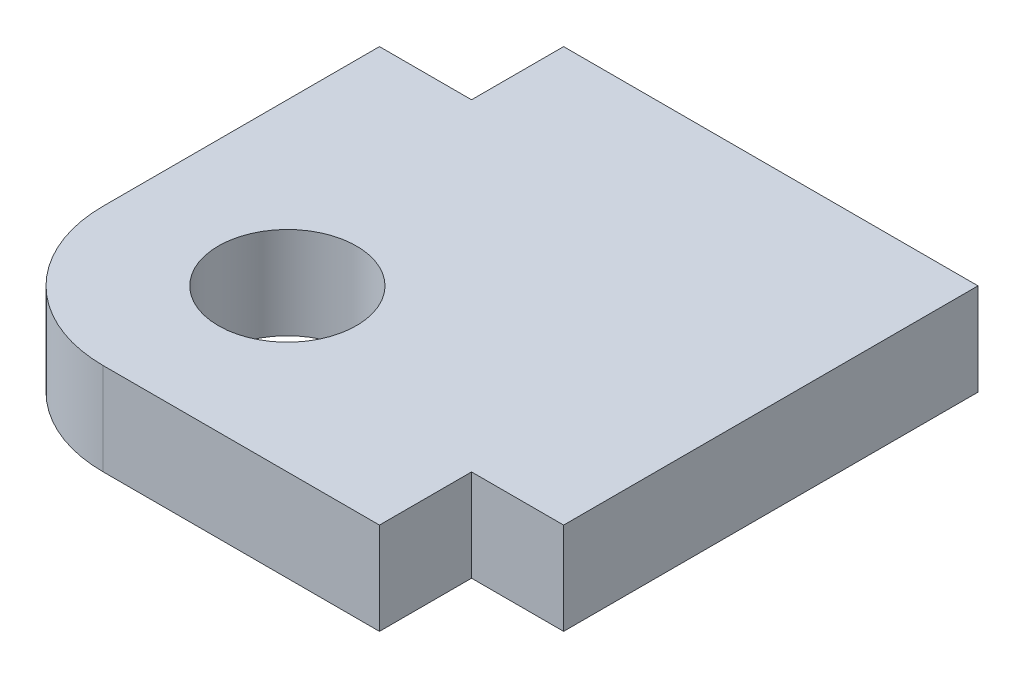
ISO-10303-21;
HEADER;
FILE_DESCRIPTION(('STEP AP214'),'2;1');
FILE_NAME('part.step','',(''),(''),'','','');
FILE_SCHEMA(('AUTOMOTIVE_DESIGN { 1 0 10303 214 1 1 1 1 }'));
ENDSEC;
DATA;
#1=APPLICATION_CONTEXT('core data for automotive mechanical design processes');
#2=APPLICATION_PROTOCOL_DEFINITION('international standard','automotive_design',2000,#1);
#3=PRODUCT_CONTEXT('',#1,'mechanical');
#4=PRODUCT('Part','Part','',(#3));
#5=PRODUCT_RELATED_PRODUCT_CATEGORY('part','',(#4));
#6=PRODUCT_DEFINITION_FORMATION('','',#4);
#7=PRODUCT_DEFINITION_CONTEXT('part definition',#1,'design');
#8=PRODUCT_DEFINITION('design','',#6,#7);
#9=PRODUCT_DEFINITION_SHAPE('','',#8);
#10=(LENGTH_UNIT() NAMED_UNIT(*) SI_UNIT(.MILLI.,.METRE.));
#11=(NAMED_UNIT(*) PLANE_ANGLE_UNIT() SI_UNIT($,.RADIAN.));
#12=(NAMED_UNIT(*) SI_UNIT($,.STERADIAN.) SOLID_ANGLE_UNIT());
#13=UNCERTAINTY_MEASURE_WITH_UNIT(LENGTH_MEASURE(1.E-05),#10,'distance_accuracy_value','');
#14=(GEOMETRIC_REPRESENTATION_CONTEXT(3) GLOBAL_UNCERTAINTY_ASSIGNED_CONTEXT((#13)) GLOBAL_UNIT_ASSIGNED_CONTEXT((#10,
#11,#12)) REPRESENTATION_CONTEXT('',''));
#15=CARTESIAN_POINT('',(0.,0.,0.));
#16=DIRECTION('',(0.,0.,1.));
#17=DIRECTION('',(1.,0.,0.));
#18=AXIS2_PLACEMENT_3D('',#15,#16,#17);
#19=CARTESIAN_POINT('',(-1.62227474992359,2.,2.06113737496184));
#20=DIRECTION('',(0.,1.,0.));
#21=DIRECTION('',(0.,0.,1.));
#22=AXIS2_PLACEMENT_3D('',#19,#20,#21);
#23=PLANE('',#22);
#24=DIRECTION('',(0.,0.,-1.));
#25=VECTOR('',#24,1.);
#26=CARTESIAN_POINT('',(6.37772525007636,2.,3.06113737496179));
#27=LINE('',#26,#25);
#28=CARTESIAN_POINT('',(6.37772525007636,2.,3.06113737496179));
#29=VERTEX_POINT('',#28);
#30=CARTESIAN_POINT('',(6.37772525007639,2.,-5.93886262503823));
#31=VERTEX_POINT('',#30);
#32=EDGE_CURVE('E156',#29,#31,#27,.T.);
#33=ORIENTED_EDGE('',*,*,#32,.T.);
#34=DIRECTION('',(-1.,0.,0.));
#35=VECTOR('',#34,1.);
#36=CARTESIAN_POINT('',(6.37772525007639,2.,-5.93886262503823));
#37=LINE('',#36,#35);
#38=CARTESIAN_POINT('',(-2.62227474992364,2.,-5.93886262503827));
#39=VERTEX_POINT('',#38);
#40=EDGE_CURVE('E99',#31,#39,#37,.T.);
#41=ORIENTED_EDGE('',*,*,#40,.T.);
#42=DIRECTION('',(0.,0.,1.));
#43=VECTOR('',#42,1.);
#44=CARTESIAN_POINT('',(-2.62227474992364,2.,-5.93886262503827));
#45=LINE('',#44,#43);
#46=CARTESIAN_POINT('',(-2.62227474992363,2.,-3.93886262503818));
#47=VERTEX_POINT('',#46);
#48=EDGE_CURVE('E174',#39,#47,#45,.T.);
#49=ORIENTED_EDGE('',*,*,#48,.T.);
#50=DIRECTION('',(-1.,0.,0.));
#51=VECTOR('',#50,1.);
#52=CARTESIAN_POINT('',(-2.62227474992363,2.,-3.93886262503818));
#53=LINE('',#52,#51);
#54=CARTESIAN_POINT('',(-4.6222747499236,2.,-3.93886262503816));
#55=VERTEX_POINT('',#54);
#56=EDGE_CURVE('E191',#47,#55,#53,.T.);
#57=ORIENTED_EDGE('',*,*,#56,.T.);
#58=DIRECTION('',(0.,0.,1.));
#59=VECTOR('',#58,1.);
#60=CARTESIAN_POINT('',(-4.6222747499236,2.,-3.93886262503816));
#61=LINE('',#60,#59);
#62=CARTESIAN_POINT('',(-4.6222747499236,2.,2.06113737496185));
#63=VERTEX_POINT('',#62);
#64=EDGE_CURVE('E190',#55,#63,#61,.T.);
#65=ORIENTED_EDGE('',*,*,#64,.T.);
#66=CARTESIAN_POINT('',(-1.62227474992359,2.,2.06113737496184));
#67=DIRECTION('',(0.,1.,0.));
#68=DIRECTION('',(0.,0.,1.));
#69=AXIS2_PLACEMENT_3D('',#66,#67,#68);
#70=CIRCLE('',#69,3.00000000000001);
#71=CARTESIAN_POINT('',(-1.62227474992359,2.,5.06113737496184));
#72=VERTEX_POINT('',#71);
#73=EDGE_CURVE('E121',#63,#72,#70,.T.);
#74=ORIENTED_EDGE('',*,*,#73,.T.);
#75=DIRECTION('',(1.,0.,0.));
#76=VECTOR('',#75,1.);
#77=CARTESIAN_POINT('',(-1.62227474992359,2.,5.06113737496184));
#78=LINE('',#77,#76);
#79=CARTESIAN_POINT('',(4.3777252500764,2.,5.06113737496183));
#80=VERTEX_POINT('',#79);
#81=EDGE_CURVE('E115',#72,#80,#78,.T.);
#82=ORIENTED_EDGE('',*,*,#81,.T.);
#83=DIRECTION('',(0.,0.,-1.));
#84=VECTOR('',#83,1.);
#85=CARTESIAN_POINT('',(4.3777252500764,2.,5.06113737496183));
#86=LINE('',#85,#84);
#87=CARTESIAN_POINT('',(4.37772525007637,2.,3.06113737496179));
#88=VERTEX_POINT('',#87);
#89=EDGE_CURVE('E119',#80,#88,#86,.T.);
#90=ORIENTED_EDGE('',*,*,#89,.T.);
#91=DIRECTION('',(1.,0.,0.));
#92=VECTOR('',#91,1.);
#93=CARTESIAN_POINT('',(4.37772525007637,2.,3.06113737496179));
#94=LINE('',#93,#92);
#95=EDGE_CURVE('E53',#88,#29,#94,.T.);
#96=ORIENTED_EDGE('',*,*,#95,.T.);
#97=EDGE_LOOP('',(#33,#41,#49,#57,#65,#74,#82,#90,#96));
#98=FACE_BOUND('',#97,.T.);
#99=CARTESIAN_POINT('',(-1.12227474992366,2.,1.56113737496182));
#100=DIRECTION('',(0.,1.,0.));
#101=DIRECTION('',(0.,0.,1.));
#102=AXIS2_PLACEMENT_3D('',#99,#100,#101);
#103=CIRCLE('',#102,1.5);
#104=CARTESIAN_POINT('',(-1.12227474992366,2.,3.06113737496182));
#105=VERTEX_POINT('',#104);
#106=EDGE_CURVE('E143',#105,#105,#103,.T.);
#107=ORIENTED_EDGE('',*,*,#106,.F.);
#108=EDGE_LOOP('',(#107));
#109=FACE_BOUND('',#108,.T.);
#110=ADVANCED_FACE('F36',(#98,#109),#23,.T.);
#111=CARTESIAN_POINT('',(-1.62227474992359,0.,2.06113737496184));
#112=DIRECTION('',(0.,1.,0.));
#113=DIRECTION('',(0.,0.,1.));
#114=AXIS2_PLACEMENT_3D('',#111,#112,#113);
#115=PLANE('',#114);
#116=DIRECTION('',(0.,0.,-1.));
#117=VECTOR('',#116,1.);
#118=CARTESIAN_POINT('',(6.37772525007636,0.,3.06113737496179));
#119=LINE('',#118,#117);
#120=CARTESIAN_POINT('',(6.37772525007636,0.,3.06113737496179));
#121=VERTEX_POINT('',#120);
#122=CARTESIAN_POINT('',(6.37772525007639,0.,-5.93886262503823));
#123=VERTEX_POINT('',#122);
#124=EDGE_CURVE('E139',#121,#123,#119,.T.);
#125=ORIENTED_EDGE('',*,*,#124,.F.);
#126=DIRECTION('',(1.,0.,0.));
#127=VECTOR('',#126,1.);
#128=CARTESIAN_POINT('',(4.37772525007637,0.,3.06113737496179));
#129=LINE('',#128,#127);
#130=CARTESIAN_POINT('',(4.37772525007637,0.,3.06113737496179));
#131=VERTEX_POINT('',#130);
#132=EDGE_CURVE('E91',#131,#121,#129,.T.);
#133=ORIENTED_EDGE('',*,*,#132,.F.);
#134=DIRECTION('',(0.,0.,-1.));
#135=VECTOR('',#134,1.);
#136=CARTESIAN_POINT('',(4.3777252500764,0.,5.06113737496183));
#137=LINE('',#136,#135);
#138=CARTESIAN_POINT('',(4.3777252500764,0.,5.06113737496183));
#139=VERTEX_POINT('',#138);
#140=EDGE_CURVE('E85',#139,#131,#137,.T.);
#141=ORIENTED_EDGE('',*,*,#140,.F.);
#142=DIRECTION('',(1.,0.,0.));
#143=VECTOR('',#142,1.);
#144=CARTESIAN_POINT('',(-1.62227474992359,0.,5.06113737496184));
#145=LINE('',#144,#143);
#146=CARTESIAN_POINT('',(-1.62227474992359,0.,5.06113737496184));
#147=VERTEX_POINT('',#146);
#148=EDGE_CURVE('E129',#147,#139,#145,.T.);
#149=ORIENTED_EDGE('',*,*,#148,.F.);
#150=CARTESIAN_POINT('',(-1.62227474992359,0.,2.06113737496184));
#151=DIRECTION('',(0.,1.,0.));
#152=DIRECTION('',(0.,0.,1.));
#153=AXIS2_PLACEMENT_3D('',#150,#151,#152);
#154=CIRCLE('',#153,3.00000000000001);
#155=CARTESIAN_POINT('',(-4.6222747499236,0.,2.06113737496185));
#156=VERTEX_POINT('',#155);
#157=EDGE_CURVE('E151',#156,#147,#154,.T.);
#158=ORIENTED_EDGE('',*,*,#157,.F.);
#159=DIRECTION('',(0.,0.,1.));
#160=VECTOR('',#159,1.);
#161=CARTESIAN_POINT('',(-4.6222747499236,0.,-3.93886262503816));
#162=LINE('',#161,#160);
#163=CARTESIAN_POINT('',(-4.6222747499236,0.,-3.93886262503816));
#164=VERTEX_POINT('',#163);
#165=EDGE_CURVE('E149',#164,#156,#162,.T.);
#166=ORIENTED_EDGE('',*,*,#165,.F.);
#167=DIRECTION('',(-1.,0.,0.));
#168=VECTOR('',#167,1.);
#169=CARTESIAN_POINT('',(-2.62227474992363,0.,-3.93886262503818));
#170=LINE('',#169,#168);
#171=CARTESIAN_POINT('',(-2.62227474992363,0.,-3.93886262503818));
#172=VERTEX_POINT('',#171);
#173=EDGE_CURVE('E147',#172,#164,#170,.T.);
#174=ORIENTED_EDGE('',*,*,#173,.F.);
#175=DIRECTION('',(0.,0.,1.));
#176=VECTOR('',#175,1.);
#177=CARTESIAN_POINT('',(-2.62227474992364,0.,-5.93886262503827));
#178=LINE('',#177,#176);
#179=CARTESIAN_POINT('',(-2.62227474992364,0.,-5.93886262503827));
#180=VERTEX_POINT('',#179);
#181=EDGE_CURVE('E145',#180,#172,#178,.T.);
#182=ORIENTED_EDGE('',*,*,#181,.F.);
#183=DIRECTION('',(-1.,0.,0.));
#184=VECTOR('',#183,1.);
#185=CARTESIAN_POINT('',(6.37772525007639,0.,-5.93886262503823));
#186=LINE('',#185,#184);
#187=EDGE_CURVE('E142',#123,#180,#186,.T.);
#188=ORIENTED_EDGE('',*,*,#187,.F.);
#189=EDGE_LOOP('',(#125,#133,#141,#149,#158,#166,#174,#182,#188));
#190=FACE_BOUND('',#189,.T.);
#191=CARTESIAN_POINT('',(-1.12227474992366,0.,1.56113737496182));
#192=DIRECTION('',(0.,1.,0.));
#193=DIRECTION('',(0.,0.,1.));
#194=AXIS2_PLACEMENT_3D('',#191,#192,#193);
#195=CIRCLE('',#194,1.5);
#196=CARTESIAN_POINT('',(-1.12227474992366,0.,3.06113737496182));
#197=VERTEX_POINT('',#196);
#198=EDGE_CURVE('E198',#197,#197,#195,.T.);
#199=ORIENTED_EDGE('',*,*,#198,.T.);
#200=EDGE_LOOP('',(#199));
#201=FACE_BOUND('',#200,.T.);
#202=ADVANCED_FACE('F178',(#190,#201),#115,.F.);
#203=CARTESIAN_POINT('',(6.37772525007636,2.,3.06113737496179));
#204=DIRECTION('',(-1.,0.,0.));
#205=DIRECTION('',(0.,0.,1.));
#206=AXIS2_PLACEMENT_3D('',#203,#204,#205);
#207=PLANE('',#206);
#208=ORIENTED_EDGE('',*,*,#124,.T.);
#209=DIRECTION('',(0.,-1.,0.));
#210=VECTOR('',#209,1.);
#211=CARTESIAN_POINT('',(6.37772525007639,2.,-5.93886262503823));
#212=LINE('',#211,#210);
#213=EDGE_CURVE('E11',#31,#123,#212,.T.);
#214=ORIENTED_EDGE('',*,*,#213,.F.);
#215=ORIENTED_EDGE('',*,*,#32,.F.);
#216=DIRECTION('',(0.,-1.,0.));
#217=VECTOR('',#216,1.);
#218=CARTESIAN_POINT('',(6.37772525007636,2.,3.06113737496179));
#219=LINE('',#218,#217);
#220=EDGE_CURVE('E135',#29,#121,#219,.T.);
#221=ORIENTED_EDGE('',*,*,#220,.T.);
#222=EDGE_LOOP('',(#208,#214,#215,#221));
#223=FACE_BOUND('',#222,.T.);
#224=ADVANCED_FACE('F38',(#223),#207,.F.);
#225=CARTESIAN_POINT('',(6.37772525007639,2.,-5.93886262503823));
#226=DIRECTION('',(0.,0.,1.));
#227=DIRECTION('',(1.,0.,0.));
#228=AXIS2_PLACEMENT_3D('',#225,#226,#227);
#229=PLANE('',#228);
#230=ORIENTED_EDGE('',*,*,#187,.T.);
#231=DIRECTION('',(0.,-1.,0.));
#232=VECTOR('',#231,1.);
#233=CARTESIAN_POINT('',(-2.62227474992364,2.,-5.93886262503827));
#234=LINE('',#233,#232);
#235=EDGE_CURVE('E45',#39,#180,#234,.T.);
#236=ORIENTED_EDGE('',*,*,#235,.F.);
#237=ORIENTED_EDGE('',*,*,#40,.F.);
#238=ORIENTED_EDGE('',*,*,#213,.T.);
#239=EDGE_LOOP('',(#230,#236,#237,#238));
#240=FACE_BOUND('',#239,.T.);
#241=ADVANCED_FACE('F230',(#240),#229,.F.);
#242=CARTESIAN_POINT('',(-2.62227474992364,2.,-5.93886262503827));
#243=DIRECTION('',(1.,0.,0.));
#244=DIRECTION('',(0.,0.,-1.));
#245=AXIS2_PLACEMENT_3D('',#242,#243,#244);
#246=PLANE('',#245);
#247=ORIENTED_EDGE('',*,*,#181,.T.);
#248=DIRECTION('',(0.,-1.,0.));
#249=VECTOR('',#248,1.);
#250=CARTESIAN_POINT('',(-2.62227474992363,2.,-3.93886262503818));
#251=LINE('',#250,#249);
#252=EDGE_CURVE('E166',#47,#172,#251,.T.);
#253=ORIENTED_EDGE('',*,*,#252,.F.);
#254=ORIENTED_EDGE('',*,*,#48,.F.);
#255=ORIENTED_EDGE('',*,*,#235,.T.);
#256=EDGE_LOOP('',(#247,#253,#254,#255));
#257=FACE_BOUND('',#256,.T.);
#258=ADVANCED_FACE('F172',(#257),#246,.F.);
#259=CARTESIAN_POINT('',(-2.62227474992363,2.,-3.93886262503818));
#260=DIRECTION('',(0.,0.,1.));
#261=DIRECTION('',(1.,0.,0.));
#262=AXIS2_PLACEMENT_3D('',#259,#260,#261);
#263=PLANE('',#262);
#264=ORIENTED_EDGE('',*,*,#173,.T.);
#265=DIRECTION('',(0.,-1.,0.));
#266=VECTOR('',#265,1.);
#267=CARTESIAN_POINT('',(-4.6222747499236,2.,-3.93886262503816));
#268=LINE('',#267,#266);
#269=EDGE_CURVE('E163',#55,#164,#268,.T.);
#270=ORIENTED_EDGE('',*,*,#269,.F.);
#271=ORIENTED_EDGE('',*,*,#56,.F.);
#272=ORIENTED_EDGE('',*,*,#252,.T.);
#273=EDGE_LOOP('',(#264,#270,#271,#272));
#274=FACE_BOUND('',#273,.T.);
#275=ADVANCED_FACE('F184',(#274),#263,.F.);
#276=CARTESIAN_POINT('',(-4.6222747499236,2.,-3.93886262503816));
#277=DIRECTION('',(1.,0.,0.));
#278=DIRECTION('',(0.,0.,-1.));
#279=AXIS2_PLACEMENT_3D('',#276,#277,#278);
#280=PLANE('',#279);
#281=ORIENTED_EDGE('',*,*,#165,.T.);
#282=DIRECTION('',(0.,-1.,0.));
#283=VECTOR('',#282,1.);
#284=CARTESIAN_POINT('',(-4.6222747499236,2.,2.06113737496185));
#285=LINE('',#284,#283);
#286=EDGE_CURVE('E160',#63,#156,#285,.T.);
#287=ORIENTED_EDGE('',*,*,#286,.F.);
#288=ORIENTED_EDGE('',*,*,#64,.F.);
#289=ORIENTED_EDGE('',*,*,#269,.T.);
#290=EDGE_LOOP('',(#281,#287,#288,#289));
#291=FACE_BOUND('',#290,.T.);
#292=ADVANCED_FACE('F188',(#291),#280,.F.);
#293=CARTESIAN_POINT('',(-1.62227474992359,2.,2.06113737496184));
#294=DIRECTION('',(0.,-1.,0.));
#295=DIRECTION('',(0.,0.,-1.));
#296=AXIS2_PLACEMENT_3D('',#293,#294,#295);
#297=CYLINDRICAL_SURFACE('',#296,3.00000000000001);
#298=ORIENTED_EDGE('',*,*,#157,.T.);
#299=DIRECTION('',(0.,-1.,0.));
#300=VECTOR('',#299,1.);
#301=CARTESIAN_POINT('',(-1.62227474992359,2.,5.06113737496184));
#302=LINE('',#301,#300);
#303=EDGE_CURVE('E130',#72,#147,#302,.T.);
#304=ORIENTED_EDGE('',*,*,#303,.F.);
#305=ORIENTED_EDGE('',*,*,#73,.F.);
#306=ORIENTED_EDGE('',*,*,#286,.T.);
#307=EDGE_LOOP('',(#298,#304,#305,#306));
#308=FACE_BOUND('',#307,.T.);
#309=ADVANCED_FACE('F221',(#308),#297,.T.);
#310=CARTESIAN_POINT('',(-1.62227474992359,2.,5.06113737496184));
#311=DIRECTION('',(0.,0.,-1.));
#312=DIRECTION('',(-1.,0.,0.));
#313=AXIS2_PLACEMENT_3D('',#310,#311,#312);
#314=PLANE('',#313);
#315=ORIENTED_EDGE('',*,*,#148,.T.);
#316=DIRECTION('',(0.,-1.,0.));
#317=VECTOR('',#316,1.);
#318=CARTESIAN_POINT('',(4.3777252500764,2.,5.06113737496183));
#319=LINE('',#318,#317);
#320=EDGE_CURVE('E126',#80,#139,#319,.T.);
#321=ORIENTED_EDGE('',*,*,#320,.F.);
#322=ORIENTED_EDGE('',*,*,#81,.F.);
#323=ORIENTED_EDGE('',*,*,#303,.T.);
#324=EDGE_LOOP('',(#315,#321,#322,#323));
#325=FACE_BOUND('',#324,.T.);
#326=ADVANCED_FACE('F127',(#325),#314,.F.);
#327=CARTESIAN_POINT('',(4.3777252500764,2.,5.06113737496183));
#328=DIRECTION('',(-1.,0.,0.));
#329=DIRECTION('',(0.,0.,1.));
#330=AXIS2_PLACEMENT_3D('',#327,#328,#329);
#331=PLANE('',#330);
#332=ORIENTED_EDGE('',*,*,#140,.T.);
#333=DIRECTION('',(0.,-1.,0.));
#334=VECTOR('',#333,1.);
#335=CARTESIAN_POINT('',(4.37772525007637,2.,3.06113737496179));
#336=LINE('',#335,#334);
#337=EDGE_CURVE('E131',#88,#131,#336,.T.);
#338=ORIENTED_EDGE('',*,*,#337,.F.);
#339=ORIENTED_EDGE('',*,*,#89,.F.);
#340=ORIENTED_EDGE('',*,*,#320,.T.);
#341=EDGE_LOOP('',(#332,#338,#339,#340));
#342=FACE_BOUND('',#341,.T.);
#343=ADVANCED_FACE('F133',(#342),#331,.F.);
#344=CARTESIAN_POINT('',(4.37772525007637,2.,3.06113737496179));
#345=DIRECTION('',(0.,0.,-1.));
#346=DIRECTION('',(-1.,0.,0.));
#347=AXIS2_PLACEMENT_3D('',#344,#345,#346);
#348=PLANE('',#347);
#349=ORIENTED_EDGE('',*,*,#132,.T.);
#350=ORIENTED_EDGE('',*,*,#220,.F.);
#351=ORIENTED_EDGE('',*,*,#95,.F.);
#352=ORIENTED_EDGE('',*,*,#337,.T.);
#353=EDGE_LOOP('',(#349,#350,#351,#352));
#354=FACE_BOUND('',#353,.T.);
#355=ADVANCED_FACE('F214',(#354),#348,.F.);
#356=CARTESIAN_POINT('',(-1.12227474992366,2.,1.56113737496182));
#357=DIRECTION('',(0.,-1.,0.));
#358=DIRECTION('',(0.,0.,-1.));
#359=AXIS2_PLACEMENT_3D('',#356,#357,#358);
#360=CYLINDRICAL_SURFACE('',#359,1.5);
#361=ORIENTED_EDGE('',*,*,#106,.T.);
#362=EDGE_LOOP('',(#361));
#363=FACE_BOUND('',#362,.T.);
#364=ORIENTED_EDGE('',*,*,#198,.F.);
#365=EDGE_LOOP('',(#364));
#366=FACE_BOUND('',#365,.T.);
#367=ADVANCED_FACE('F204',(#363,#366),#360,.F.);
#368=CLOSED_SHELL('',(#110,#202,#224,#241,#258,#275,#292,#309,#326,#343,#355,#367));
#369=MANIFOLD_SOLID_BREP('B2',#368);
#370=ADVANCED_BREP_SHAPE_REPRESENTATION('',(#18,#369),#14);
#371=SHAPE_DEFINITION_REPRESENTATION(#9,#370);
ENDSEC;
END-ISO-10303-21;
